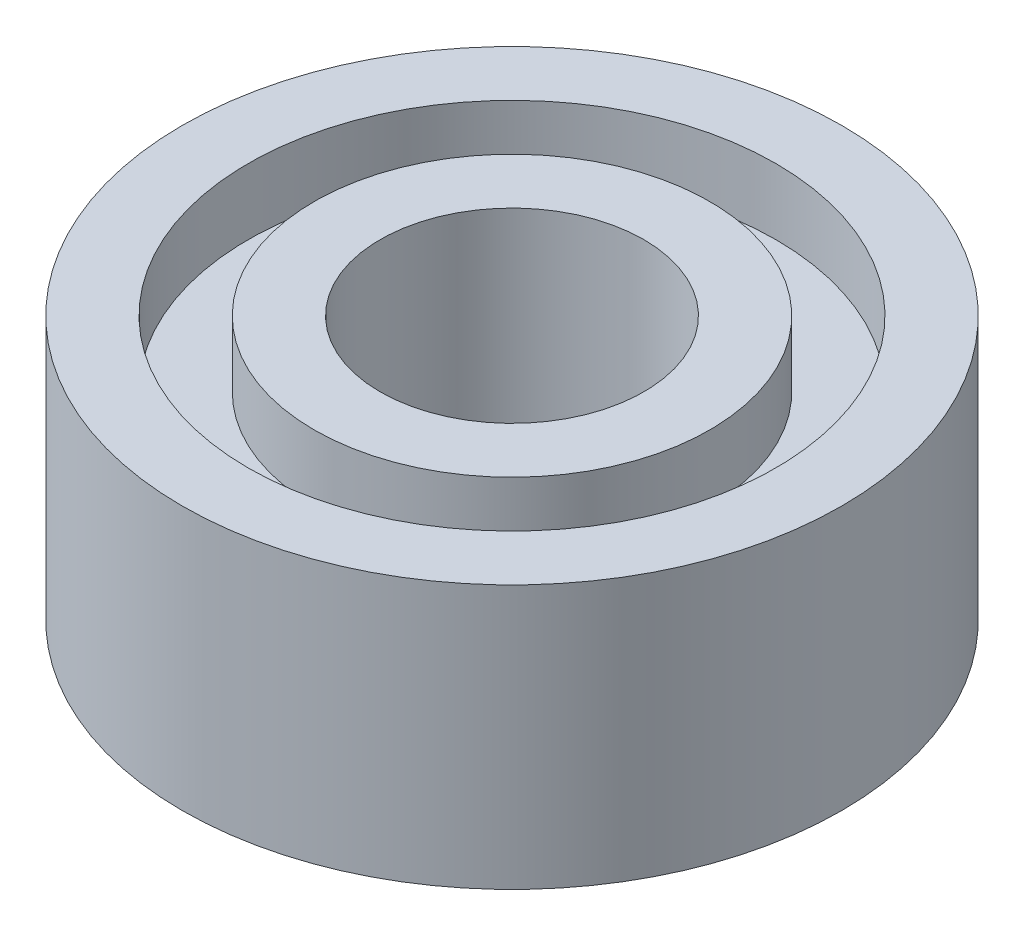
ISO-10303-21;
HEADER;
FILE_DESCRIPTION(('STEP AP214'),'2;1');
FILE_NAME('part.step','',(''),(''),'','','');
FILE_SCHEMA(('AUTOMOTIVE_DESIGN { 1 0 10303 214 1 1 1 1 }'));
ENDSEC;
DATA;
#1=APPLICATION_CONTEXT('core data for automotive mechanical design processes');
#2=APPLICATION_PROTOCOL_DEFINITION('international standard','automotive_design',2000,#1);
#3=PRODUCT_CONTEXT('',#1,'mechanical');
#4=PRODUCT('Part','Part','',(#3));
#5=PRODUCT_RELATED_PRODUCT_CATEGORY('part','',(#4));
#6=PRODUCT_DEFINITION_FORMATION('','',#4);
#7=PRODUCT_DEFINITION_CONTEXT('part definition',#1,'design');
#8=PRODUCT_DEFINITION('design','',#6,#7);
#9=PRODUCT_DEFINITION_SHAPE('','',#8);
#10=(LENGTH_UNIT() NAMED_UNIT(*) SI_UNIT(.MILLI.,.METRE.));
#11=(NAMED_UNIT(*) PLANE_ANGLE_UNIT() SI_UNIT($,.RADIAN.));
#12=(NAMED_UNIT(*) SI_UNIT($,.STERADIAN.) SOLID_ANGLE_UNIT());
#13=UNCERTAINTY_MEASURE_WITH_UNIT(LENGTH_MEASURE(1.E-05),#10,'distance_accuracy_value','');
#14=(GEOMETRIC_REPRESENTATION_CONTEXT(3) GLOBAL_UNCERTAINTY_ASSIGNED_CONTEXT((#13)) GLOBAL_UNIT_ASSIGNED_CONTEXT((#10,
#11,#12)) REPRESENTATION_CONTEXT('',''));
#15=CARTESIAN_POINT('',(0.,0.,0.));
#16=DIRECTION('',(0.,0.,1.));
#17=DIRECTION('',(1.,0.,0.));
#18=AXIS2_PLACEMENT_3D('',#15,#16,#17);
#19=CARTESIAN_POINT('',(0.,0.,0.));
#20=DIRECTION('',(0.,1.,0.));
#21=DIRECTION('',(0.,0.,1.));
#22=AXIS2_PLACEMENT_3D('',#19,#20,#21);
#23=PLANE('',#22);
#24=CARTESIAN_POINT('',(0.,0.,0.));
#25=DIRECTION('',(0.,1.,0.));
#26=DIRECTION('',(0.,0.,1.));
#27=AXIS2_PLACEMENT_3D('',#24,#25,#26);
#28=CIRCLE('',#27,2.);
#29=CARTESIAN_POINT('',(0.,0.,2.));
#30=VERTEX_POINT('',#29);
#31=EDGE_CURVE('E52',#30,#30,#28,.T.);
#32=ORIENTED_EDGE('',*,*,#31,.T.);
#33=EDGE_LOOP('',(#32));
#34=FACE_BOUND('',#33,.T.);
#35=CARTESIAN_POINT('',(0.,0.,0.));
#36=DIRECTION('',(0.,-1.,0.));
#37=DIRECTION('',(0.,0.,-1.));
#38=AXIS2_PLACEMENT_3D('',#35,#36,#37);
#39=CIRCLE('',#38,3.);
#40=CARTESIAN_POINT('',(0.,0.,-3.));
#41=VERTEX_POINT('',#40);
#42=EDGE_CURVE('E76',#41,#41,#39,.T.);
#43=ORIENTED_EDGE('',*,*,#42,.T.);
#44=EDGE_LOOP('',(#43));
#45=FACE_BOUND('',#44,.T.);
#46=ADVANCED_FACE('F39',(#34,#45),#23,.F.);
#47=CARTESIAN_POINT('',(0.,4.,0.));
#48=DIRECTION('',(0.,1.,0.));
#49=DIRECTION('',(0.,0.,1.));
#50=AXIS2_PLACEMENT_3D('',#47,#48,#49);
#51=PLANE('',#50);
#52=CARTESIAN_POINT('',(0.,4.,0.));
#53=DIRECTION('',(0.,1.,0.));
#54=DIRECTION('',(0.,0.,1.));
#55=AXIS2_PLACEMENT_3D('',#52,#53,#54);
#56=CIRCLE('',#55,2.);
#57=CARTESIAN_POINT('',(0.,4.,2.));
#58=VERTEX_POINT('',#57);
#59=EDGE_CURVE('E50',#58,#58,#56,.T.);
#60=ORIENTED_EDGE('',*,*,#59,.F.);
#61=EDGE_LOOP('',(#60));
#62=FACE_BOUND('',#61,.T.);
#63=CARTESIAN_POINT('',(0.,4.,0.));
#64=DIRECTION('',(0.,1.,0.));
#65=DIRECTION('',(0.,0.,1.));
#66=AXIS2_PLACEMENT_3D('',#63,#64,#65);
#67=CIRCLE('',#66,3.);
#68=CARTESIAN_POINT('',(0.,4.,3.));
#69=VERTEX_POINT('',#68);
#70=EDGE_CURVE('E64',#69,#69,#67,.T.);
#71=ORIENTED_EDGE('',*,*,#70,.T.);
#72=EDGE_LOOP('',(#71));
#73=FACE_BOUND('',#72,.T.);
#74=ADVANCED_FACE('F114',(#62,#73),#51,.T.);
#75=CARTESIAN_POINT('',(0.,4.,0.));
#76=DIRECTION('',(0.,1.,0.));
#77=DIRECTION('',(0.,0.,1.));
#78=AXIS2_PLACEMENT_3D('',#75,#76,#77);
#79=CIRCLE('',#78,4.);
#80=CARTESIAN_POINT('',(0.,4.,4.));
#81=VERTEX_POINT('',#80);
#82=EDGE_CURVE('E58',#81,#81,#79,.T.);
#83=ORIENTED_EDGE('',*,*,#82,.F.);
#84=EDGE_LOOP('',(#83));
#85=FACE_BOUND('',#84,.T.);
#86=CARTESIAN_POINT('',(0.,4.,0.));
#87=DIRECTION('',(0.,1.,0.));
#88=DIRECTION('',(0.,0.,1.));
#89=AXIS2_PLACEMENT_3D('',#86,#87,#88);
#90=CIRCLE('',#89,5.);
#91=CARTESIAN_POINT('',(0.,4.,5.));
#92=VERTEX_POINT('',#91);
#93=EDGE_CURVE('E10',#92,#92,#90,.T.);
#94=ORIENTED_EDGE('',*,*,#93,.T.);
#95=EDGE_LOOP('',(#94));
#96=FACE_BOUND('',#95,.T.);
#97=ADVANCED_FACE('F101',(#85,#96),#51,.T.);
#98=CARTESIAN_POINT('',(0.,0.,0.));
#99=DIRECTION('',(0.,-1.,0.));
#100=DIRECTION('',(0.,0.,-1.));
#101=AXIS2_PLACEMENT_3D('',#98,#99,#100);
#102=CIRCLE('',#101,4.);
#103=CARTESIAN_POINT('',(0.,0.,-4.));
#104=VERTEX_POINT('',#103);
#105=EDGE_CURVE('E70',#104,#104,#102,.T.);
#106=ORIENTED_EDGE('',*,*,#105,.F.);
#107=EDGE_LOOP('',(#106));
#108=FACE_BOUND('',#107,.T.);
#109=CARTESIAN_POINT('',(0.,0.,0.));
#110=DIRECTION('',(0.,1.,0.));
#111=DIRECTION('',(0.,0.,1.));
#112=AXIS2_PLACEMENT_3D('',#109,#110,#111);
#113=CIRCLE('',#112,5.);
#114=CARTESIAN_POINT('',(0.,0.,5.));
#115=VERTEX_POINT('',#114);
#116=EDGE_CURVE('E43',#115,#115,#113,.T.);
#117=ORIENTED_EDGE('',*,*,#116,.F.);
#118=EDGE_LOOP('',(#117));
#119=FACE_BOUND('',#118,.T.);
#120=ADVANCED_FACE('F98',(#108,#119),#23,.F.);
#121=CARTESIAN_POINT('',(0.,4.,0.));
#122=DIRECTION('',(0.,-1.,0.));
#123=DIRECTION('',(0.,0.,-1.));
#124=AXIS2_PLACEMENT_3D('',#121,#122,#123);
#125=CYLINDRICAL_SURFACE('',#124,5.);
#126=ORIENTED_EDGE('',*,*,#93,.F.);
#127=EDGE_LOOP('',(#126));
#128=FACE_BOUND('',#127,.T.);
#129=ORIENTED_EDGE('',*,*,#116,.T.);
#130=EDGE_LOOP('',(#129));
#131=FACE_BOUND('',#130,.T.);
#132=ADVANCED_FACE('F41',(#128,#131),#125,.T.);
#133=CARTESIAN_POINT('',(0.,4.,0.));
#134=DIRECTION('',(0.,-1.,0.));
#135=DIRECTION('',(0.,0.,-1.));
#136=AXIS2_PLACEMENT_3D('',#133,#134,#135);
#137=CYLINDRICAL_SURFACE('',#136,2.);
#138=ORIENTED_EDGE('',*,*,#59,.T.);
#139=EDGE_LOOP('',(#138));
#140=FACE_BOUND('',#139,.T.);
#141=ORIENTED_EDGE('',*,*,#31,.F.);
#142=EDGE_LOOP('',(#141));
#143=FACE_BOUND('',#142,.T.);
#144=ADVANCED_FACE('F105',(#140,#143),#137,.F.);
#145=CARTESIAN_POINT('',(0.,3.,0.));
#146=DIRECTION('',(0.,1.,0.));
#147=DIRECTION('',(0.,0.,1.));
#148=AXIS2_PLACEMENT_3D('',#145,#146,#147);
#149=CYLINDRICAL_SURFACE('',#148,4.);
#150=CARTESIAN_POINT('',(0.,3.,0.));
#151=DIRECTION('',(0.,1.,0.));
#152=DIRECTION('',(0.,0.,1.));
#153=AXIS2_PLACEMENT_3D('',#150,#151,#152);
#154=CIRCLE('',#153,4.);
#155=CARTESIAN_POINT('',(0.,3.,4.));
#156=VERTEX_POINT('',#155);
#157=EDGE_CURVE('E55',#156,#156,#154,.T.);
#158=ORIENTED_EDGE('',*,*,#157,.F.);
#159=EDGE_LOOP('',(#158));
#160=FACE_BOUND('',#159,.T.);
#161=ORIENTED_EDGE('',*,*,#82,.T.);
#162=EDGE_LOOP('',(#161));
#163=FACE_BOUND('',#162,.T.);
#164=ADVANCED_FACE('F110',(#160,#163),#149,.F.);
#165=CARTESIAN_POINT('',(0.,3.,0.));
#166=DIRECTION('',(0.,1.,0.));
#167=DIRECTION('',(0.,0.,1.));
#168=AXIS2_PLACEMENT_3D('',#165,#166,#167);
#169=PLANE('',#168);
#170=CARTESIAN_POINT('',(0.,3.,0.));
#171=DIRECTION('',(0.,1.,0.));
#172=DIRECTION('',(0.,0.,1.));
#173=AXIS2_PLACEMENT_3D('',#170,#171,#172);
#174=CIRCLE('',#173,3.);
#175=CARTESIAN_POINT('',(0.,3.,3.));
#176=VERTEX_POINT('',#175);
#177=EDGE_CURVE('E61',#176,#176,#174,.T.);
#178=ORIENTED_EDGE('',*,*,#177,.F.);
#179=EDGE_LOOP('',(#178));
#180=FACE_BOUND('',#179,.T.);
#181=ORIENTED_EDGE('',*,*,#157,.T.);
#182=EDGE_LOOP('',(#181));
#183=FACE_BOUND('',#182,.T.);
#184=ADVANCED_FACE('F127',(#180,#183),#169,.T.);
#185=CARTESIAN_POINT('',(0.,3.,0.));
#186=DIRECTION('',(0.,1.,0.));
#187=DIRECTION('',(0.,0.,1.));
#188=AXIS2_PLACEMENT_3D('',#185,#186,#187);
#189=CYLINDRICAL_SURFACE('',#188,3.);
#190=ORIENTED_EDGE('',*,*,#177,.T.);
#191=EDGE_LOOP('',(#190));
#192=FACE_BOUND('',#191,.T.);
#193=ORIENTED_EDGE('',*,*,#70,.F.);
#194=EDGE_LOOP('',(#193));
#195=FACE_BOUND('',#194,.T.);
#196=ADVANCED_FACE('F94',(#192,#195),#189,.T.);
#197=CARTESIAN_POINT('',(0.,1.,0.));
#198=DIRECTION('',(0.,-1.,0.));
#199=DIRECTION('',(0.,0.,-1.));
#200=AXIS2_PLACEMENT_3D('',#197,#198,#199);
#201=CYLINDRICAL_SURFACE('',#200,4.);
#202=CARTESIAN_POINT('',(0.,1.,0.));
#203=DIRECTION('',(0.,-1.,0.));
#204=DIRECTION('',(0.,0.,-1.));
#205=AXIS2_PLACEMENT_3D('',#202,#203,#204);
#206=CIRCLE('',#205,4.);
#207=CARTESIAN_POINT('',(0.,1.,-4.));
#208=VERTEX_POINT('',#207);
#209=EDGE_CURVE('E67',#208,#208,#206,.T.);
#210=ORIENTED_EDGE('',*,*,#209,.F.);
#211=EDGE_LOOP('',(#210));
#212=FACE_BOUND('',#211,.T.);
#213=ORIENTED_EDGE('',*,*,#105,.T.);
#214=EDGE_LOOP('',(#213));
#215=FACE_BOUND('',#214,.T.);
#216=ADVANCED_FACE('F88',(#212,#215),#201,.F.);
#217=CARTESIAN_POINT('',(0.,1.,0.));
#218=DIRECTION('',(0.,-1.,0.));
#219=DIRECTION('',(0.,0.,-1.));
#220=AXIS2_PLACEMENT_3D('',#217,#218,#219);
#221=PLANE('',#220);
#222=CARTESIAN_POINT('',(0.,1.,0.));
#223=DIRECTION('',(0.,-1.,0.));
#224=DIRECTION('',(0.,0.,-1.));
#225=AXIS2_PLACEMENT_3D('',#222,#223,#224);
#226=CIRCLE('',#225,3.);
#227=CARTESIAN_POINT('',(0.,1.,-3.));
#228=VERTEX_POINT('',#227);
#229=EDGE_CURVE('E73',#228,#228,#226,.T.);
#230=ORIENTED_EDGE('',*,*,#229,.F.);
#231=EDGE_LOOP('',(#230));
#232=FACE_BOUND('',#231,.T.);
#233=ORIENTED_EDGE('',*,*,#209,.T.);
#234=EDGE_LOOP('',(#233));
#235=FACE_BOUND('',#234,.T.);
#236=ADVANCED_FACE('F85',(#232,#235),#221,.T.);
#237=CARTESIAN_POINT('',(0.,1.,0.));
#238=DIRECTION('',(0.,-1.,0.));
#239=DIRECTION('',(0.,0.,-1.));
#240=AXIS2_PLACEMENT_3D('',#237,#238,#239);
#241=CYLINDRICAL_SURFACE('',#240,3.);
#242=ORIENTED_EDGE('',*,*,#229,.T.);
#243=EDGE_LOOP('',(#242));
#244=FACE_BOUND('',#243,.T.);
#245=ORIENTED_EDGE('',*,*,#42,.F.);
#246=EDGE_LOOP('',(#245));
#247=FACE_BOUND('',#246,.T.);
#248=ADVANCED_FACE('F82',(#244,#247),#241,.T.);
#249=CLOSED_SHELL('',(#46,#74,#97,#120,#132,#144,#164,#184,#196,#216,#236,#248));
#250=MANIFOLD_SOLID_BREP('B2',#249);
#251=ADVANCED_BREP_SHAPE_REPRESENTATION('',(#18,#250),#14);
#252=SHAPE_DEFINITION_REPRESENTATION(#9,#251);
ENDSEC;
END-ISO-10303-21;
